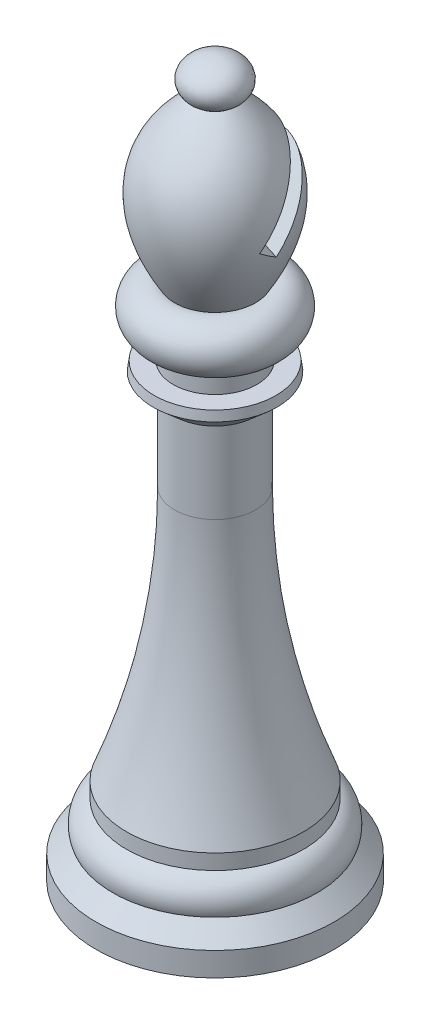
ISO-10303-21;
HEADER;
FILE_DESCRIPTION(('STEP AP214'),'2;1');
FILE_NAME('part.step','',(''),(''),'','','');
FILE_SCHEMA(('AUTOMOTIVE_DESIGN { 1 0 10303 214 1 1 1 1 }'));
ENDSEC;
DATA;
#1=APPLICATION_CONTEXT('core data for automotive mechanical design processes');
#2=APPLICATION_PROTOCOL_DEFINITION('international standard','automotive_design',2000,#1);
#3=PRODUCT_CONTEXT('',#1,'mechanical');
#4=PRODUCT('Part','Part','',(#3));
#5=PRODUCT_RELATED_PRODUCT_CATEGORY('part','',(#4));
#6=PRODUCT_DEFINITION_FORMATION('','',#4);
#7=PRODUCT_DEFINITION_CONTEXT('part definition',#1,'design');
#8=PRODUCT_DEFINITION('design','',#6,#7);
#9=PRODUCT_DEFINITION_SHAPE('','',#8);
#10=(LENGTH_UNIT() NAMED_UNIT(*) SI_UNIT(.MILLI.,.METRE.));
#11=(NAMED_UNIT(*) PLANE_ANGLE_UNIT() SI_UNIT($,.RADIAN.));
#12=(NAMED_UNIT(*) SI_UNIT($,.STERADIAN.) SOLID_ANGLE_UNIT());
#13=UNCERTAINTY_MEASURE_WITH_UNIT(LENGTH_MEASURE(1.E-05),#10,'distance_accuracy_value','');
#14=(GEOMETRIC_REPRESENTATION_CONTEXT(3) GLOBAL_UNCERTAINTY_ASSIGNED_CONTEXT((#13)) GLOBAL_UNIT_ASSIGNED_CONTEXT((#10,
#11,#12)) REPRESENTATION_CONTEXT('',''));
#15=CARTESIAN_POINT('',(0.,0.,0.));
#16=DIRECTION('',(0.,0.,1.));
#17=DIRECTION('',(1.,0.,0.));
#18=AXIS2_PLACEMENT_3D('',#15,#16,#17);
#19=CARTESIAN_POINT('',(1.00027326815392,36.2297140379985,0.));
#20=CARTESIAN_POINT('',(5.27541449812885,32.9314503318034,0.));
#21=CARTESIAN_POINT('',(2.16294521673095,27.7758178204863,0.));
#22=B_SPLINE_CURVE_WITH_KNOTS('',2,(#19,#20,#21),.UNSPECIFIED.,.F.,.F.,(3,3),(0.,1.),.UNSPECIFIED.);
#23=CARTESIAN_POINT('',(0.,0.,0.));
#24=DIRECTION('',(0.,-1.,0.));
#25=AXIS1_PLACEMENT('',#23,#24);
#26=SURFACE_OF_REVOLUTION('',#22,#25);
#27=CARTESIAN_POINT('',(0.,36.2297140379985,0.));
#28=DIRECTION('',(0.,-1.,0.));
#29=DIRECTION('',(0.,0.,-1.));
#30=AXIS2_PLACEMENT_3D('',#27,#28,#29);
#31=CIRCLE('',#30,1.00027326815392);
#32=CARTESIAN_POINT('',(0.,36.2297140379985,-1.00027326815392));
#33=VERTEX_POINT('',#32);
#34=EDGE_CURVE('E87',#33,#33,#31,.T.);
#35=ORIENTED_EDGE('',*,*,#34,.T.);
#36=EDGE_LOOP('',(#35));
#37=FACE_BOUND('',#36,.T.);
#38=CARTESIAN_POINT('',(0.,27.7758178204863,0.));
#39=DIRECTION('',(0.,-1.,0.));
#40=DIRECTION('',(0.,0.,-1.));
#41=AXIS2_PLACEMENT_3D('',#38,#39,#40);
#42=CIRCLE('',#41,2.16294521673095);
#43=CARTESIAN_POINT('',(0.,27.7758178204863,-2.16294521673095));
#44=VERTEX_POINT('',#43);
#45=EDGE_CURVE('E305',#44,#44,#42,.T.);
#46=ORIENTED_EDGE('',*,*,#45,.F.);
#47=EDGE_LOOP('',(#46));
#48=FACE_BOUND('',#47,.T.);
#49=CARTESIAN_POINT('',(3.28289071920414,30.3475365563568,0.146879739243502));
#50=CARTESIAN_POINT('',(3.30739566453259,30.4346457791315,0.0910765578843733));
#51=CARTESIAN_POINT('',(3.32871348183493,30.5219162735567,0.0341535928762741));
#52=CARTESIAN_POINT('',(3.36459165647857,30.6964938412345,-0.0818439158584685));
#53=CARTESIAN_POINT('',(3.37914772383222,30.7838009026297,-0.14091979994399));
#54=CARTESIAN_POINT('',(3.4121455490095,31.0458856481982,-0.32162204256579));
#55=CARTESIAN_POINT('',(3.41971199591901,31.220116538539,-0.446269533987425));
#56=CARTESIAN_POINT('',(3.40284418352598,31.5616607799071,-0.70058388472676));
#57=CARTESIAN_POINT('',(3.37863120380716,31.7290136848451,-0.830209999432373));
#58=CARTESIAN_POINT('',(3.31716748616846,31.9717966144672,-1.02654364405817));
#59=CARTESIAN_POINT('',(3.29249793366688,32.0513314973952,-1.09228770572346));
#60=CARTESIAN_POINT('',(3.23466661455085,32.2070404251162,-1.22399594795197));
#61=CARTESIAN_POINT('',(3.20150847278785,32.2832158882337,-1.28996002272628));
#62=CARTESIAN_POINT('',(3.12640510657,32.432023147504,-1.42206771846514));
#63=CARTESIAN_POINT('',(3.0844008753129,32.5046268906878,-1.48820944173056));
#64=CARTESIAN_POINT('',(2.9918483733432,32.64495155537,-1.61961966889064));
#65=CARTESIAN_POINT('',(2.94130440317388,32.7126749102249,-1.68488859455333));
#66=CARTESIAN_POINT('',(2.83181026173759,32.8425768490505,-1.81402727433951));
#67=CARTESIAN_POINT('',(2.77285356019037,32.904751064051,-1.87789589664355));
#68=CARTESIAN_POINT('',(2.6469115552805,33.0227076792522,-2.00349767647071));
#69=CARTESIAN_POINT('',(2.57993126542464,33.0784940286969,-2.06523213675828));
#70=CARTESIAN_POINT('',(2.44612591240476,33.1772392949089,-2.17930012905844));
#71=CARTESIAN_POINT('',(2.38008871287919,33.2209339960284,-2.2319223536804));
#72=CARTESIAN_POINT('',(2.24241439979847,33.3021687849837,-2.33444056450346));
#73=CARTESIAN_POINT('',(2.17078055362957,33.3397124248084,-2.38433811291603));
#74=CARTESIAN_POINT('',(2.02241899185135,33.4081690843677,-2.48090080055351));
#75=CARTESIAN_POINT('',(1.94569447826206,33.4390862213421,-2.52756793465296));
#76=CARTESIAN_POINT('',(1.78770232576549,33.4938814932487,-2.61719887031084));
#77=CARTESIAN_POINT('',(1.70643513555066,33.5177603219172,-2.66016303655959));
#78=CARTESIAN_POINT('',(1.54852810404349,33.5560589258623,-2.73773995378869));
#79=CARTESIAN_POINT('',(1.47225984433482,33.5711943458995,-2.77275761572079));
#80=CARTESIAN_POINT('',(1.31715351578733,33.5953007195932,-2.83910668902551));
#81=CARTESIAN_POINT('',(1.23831461335242,33.6042696523623,-2.87043688915404));
#82=CARTESIAN_POINT('',(1.07876586611293,33.6159031947374,-2.92908931181643));
#83=CARTESIAN_POINT('',(0.998057478181527,33.6185725570082,-2.95641454126357));
#84=CARTESIAN_POINT('',(0.835365551001336,33.6175918931001,-3.00685869002682));
#85=CARTESIAN_POINT('',(0.753381565492461,33.6139396037195,-3.02997609963527));
#86=CARTESIAN_POINT('',(0.516702885219877,33.5943769112375,-3.09013804793633));
#87=CARTESIAN_POINT('',(0.361154498955149,33.5705370098276,-3.12166986144353));
#88=CARTESIAN_POINT('',(0.052411468459435,33.5018170097783,-3.1686535350598));
#89=CARTESIAN_POINT('',(-0.100782979126392,33.4569351630839,-3.18410405887572));
#90=CARTESIAN_POINT('',(-0.403720882142854,33.3470491155261,-3.19924929174036));
#91=CARTESIAN_POINT('',(-0.55335148105557,33.2816949814056,-3.1986533862155));
#92=CARTESIAN_POINT('',(-0.842749510702654,33.133596182917,-3.18168112135541));
#93=CARTESIAN_POINT('',(-0.982514621717074,33.050847446547,-3.16530106379429));
#94=CARTESIAN_POINT('',(-1.25958121078357,32.8637226323111,-3.11599836943598));
#95=CARTESIAN_POINT('',(-1.39588429492666,32.75817935788,-3.08191081386171));
#96=CARTESIAN_POINT('',(-1.65129435260489,32.533271161257,-2.99825134681673));
#97=CARTESIAN_POINT('',(-1.77039580786446,32.4139018257019,-2.94867448244458));
#98=CARTESIAN_POINT('',(-1.93995067942691,32.2211684386615,-2.86147525028221));
#99=CARTESIAN_POINT('',(-1.99709396477578,32.151407372221,-2.82858337239887));
#100=CARTESIAN_POINT('',(-2.1055410486553,32.0092545327673,-2.75904539339884));
#101=CARTESIAN_POINT('',(-2.1568451503602,31.9368628965929,-2.72239948738165));
#102=CARTESIAN_POINT('',(-2.25349347577079,31.789964745634,-2.64569167013681));
#103=CARTESIAN_POINT('',(-2.29883829578294,31.715458443359,-2.6056301013547));
#104=CARTESIAN_POINT('',(-2.38356652705777,31.5647710965063,-2.52241136810325));
#105=CARTESIAN_POINT('',(-2.42294705033473,31.488589260931,-2.47925271880136));
#106=CARTESIAN_POINT('',(-2.54092903120835,31.2396841855446,-2.3348830045978));
#107=CARTESIAN_POINT('',(-2.60759322330927,31.0644179890326,-2.22806422166601));
#108=CARTESIAN_POINT('',(-2.71220232410782,30.7119821377859,-2.00400800572556));
#109=CARTESIAN_POINT('',(-2.75012161661181,30.5348109276237,-1.88676138358502));
#110=CARTESIAN_POINT('',(-2.78547250171757,30.2805274615796,-1.71248676120583));
#111=CARTESIAN_POINT('',(-2.79368937343487,30.2027552951701,-1.65836911282801));
#112=CARTESIAN_POINT('',(-2.80506640962539,30.0477817972258,-1.54895989387154));
#113=CARTESIAN_POINT('',(-2.80823216753689,29.9705799286291,-1.49366969061524));
#114=CARTESIAN_POINT('',(-2.80968604863595,29.8171998595871,-1.38230181984043));
#115=CARTESIAN_POINT('',(-2.8079944059348,29.7410187368691,-1.32622838447272));
#116=CARTESIAN_POINT('',(-2.79991918763948,29.5894642447292,-1.21319502676869));
#117=CARTESIAN_POINT('',(-2.79353156473607,29.5140916290218,-1.15623438125172));
#118=CARTESIAN_POINT('',(-2.78486870103948,29.4392440249039,-1.09894104825655));
#119=B_SPLINE_CURVE_WITH_KNOTS('',3,(#49,#50,#51,#52,#53,#54,#55,#56,#57,#58,#59,#60,#61,#62,
#63,#64,#65,#66,#67,#68,#69,#70,#71,#72,#73,#74,#75,#76,#77,#78,#79,#80,#81,#82,#83,#84,#85,#86,
#87,#88,#89,#90,#91,#92,#93,#94,#95,#96,#97,#98,#99,#100,#101,#102,#103,#104,#105,#106,#107,
#108,#109,#110,#111,#112,#113,#114,#115,#116,#117,#118),.UNSPECIFIED.,.F.,.F.,(4,2,2,2,2,2,2,2,
2,2,2,2,2,2,2,2,2,2,2,2,2,2,2,2,2,2,2,2,2,2,2,2,2,2,4),(0.,0.318844017788566,0.637890050587816,
1.27856193841117,1.91479641923145,2.23275891757237,2.55058586337101,2.87060408246469,
3.19046162072267,3.5105688089673,3.83047701274286,4.115316703928,4.3999913275295,
4.68448855840563,4.96895773820623,5.22445711510258,5.48004018465832,5.73543036971176,
5.9909120053937,6.46993714846769,6.94900209350626,7.43674905397591,7.92461032132313,
8.44962869816349,8.97481512835657,9.26253467886508,9.55023928396404,9.83791507838369,
10.125729726647,10.7705316887195,11.4159075966859,11.7011092441502,11.9859948488941,
12.2696954507169,12.5536408517343),.UNSPECIFIED.);
#120=CARTESIAN_POINT('',(3.32013077300235,30.4902616829391,0.054533188415232));
#121=VERTEX_POINT('',#120);
#122=CARTESIAN_POINT('',(-2.75382634408267,30.4902616829391,-1.85544676159467));
#123=VERTEX_POINT('',#122);
#124=EDGE_CURVE('E11',#121,#123,#119,.T.);
#125=ORIENTED_EDGE('',*,*,#124,.F.);
#126=CARTESIAN_POINT('',(3.27319233672416,31.1593243859053,1.04820710477854));
#127=CARTESIAN_POINT('',(3.29486884035974,31.0930829056387,0.955181972038542));
#128=CARTESIAN_POINT('',(3.31160027531774,31.0270608597655,0.86093258172998));
#129=CARTESIAN_POINT('',(3.33512804855597,30.8958799461817,0.670610681754513));
#130=CARTESIAN_POINT('',(3.34192442836695,30.830721074864,0.574538179710322));
#131=CARTESIAN_POINT('',(3.34734413096126,30.6371614867713,0.284502880781126));
#132=CARTESIAN_POINT('',(3.33099350791637,30.5106916931443,0.0887418196909726));
#133=CARTESIAN_POINT('',(3.25976249429006,30.2712033540758,-0.294621965594113));
#134=CARTESIAN_POINT('',(3.20617655959479,30.1578779792932,-0.482280106533866));
#135=CARTESIAN_POINT('',(3.06235480401658,29.9435079055063,-0.850611241610111));
#136=CARTESIAN_POINT('',(2.97214150369579,29.8424557097731,-1.03128845338923));
#137=CARTESIAN_POINT('',(2.81211027122135,29.7045666487194,-1.28944195841348));
#138=CARTESIAN_POINT('',(2.7557264422415,29.6614664473747,-1.37213415604832));
#139=CARTESIAN_POINT('',(2.63490333506536,29.5795263685417,-1.53363031538285));
#140=CARTESIAN_POINT('',(2.57046833415689,29.5406842493114,-1.61243631090143));
#141=CARTESIAN_POINT('',(2.43381968663126,29.4677101516073,-1.76539504482241));
#142=CARTESIAN_POINT('',(2.36160364560027,29.4335796304188,-1.83954633968811));
#143=CARTESIAN_POINT('',(2.20983291580817,29.3705057108861,-1.98233838968447));
#144=CARTESIAN_POINT('',(2.13027944008037,29.341561457462,-2.05098005217726));
#145=CARTESIAN_POINT('',(1.97234980003041,29.2918037053487,-2.17563821887409));
#146=CARTESIAN_POINT('',(1.8945920220891,29.2704767257871,-2.23223420473015));
#147=CARTESIAN_POINT('',(1.73405812978078,29.2327112485538,-2.33963612732694));
#148=CARTESIAN_POINT('',(1.65128280129051,29.2162719877097,-2.39044296722462));
#149=CARTESIAN_POINT('',(1.48155143655996,29.1885563175991,-2.48558966298299));
#150=CARTESIAN_POINT('',(1.39460638261902,29.1772670893709,-2.52994538658777));
#151=CARTESIAN_POINT('',(1.21710539736459,29.159973147302,-2.61182729003924));
#152=CARTESIAN_POINT('',(1.12655229399399,29.1539643766801,-2.64935869514558));
#153=CARTESIAN_POINT('',(1.0050122151014,29.1495685611332,-2.6942029774859));
#154=CARTESIAN_POINT('',(0.975265938336568,29.1487761278986,-2.70475119453446));
#155=CARTESIAN_POINT('',(0.915539112260839,29.14774837292,-2.7250815993171));
#156=CARTESIAN_POINT('',(0.88555885108079,29.1475124496378,-2.73486460310604));
#157=CARTESIAN_POINT('',(0.855455770516862,29.1475542517186,-2.74426763089485));
#158=B_SPLINE_CURVE_WITH_KNOTS('',3,(#126,#127,#128,#129,#130,#131,#132,#133,#134,#135,#136,
#137,#138,#139,#140,#141,#142,#143,#144,#145,#146,#147,#148,#149,#150,#151,#152,#153,#154,#155,
#156,#157),.UNSPECIFIED.,.F.,.F.,(4,2,2,2,2,2,2,2,2,2,2,2,2,2,2,4),(0.,0.348472920187196,
0.696944383675538,1.39395949505938,2.06788217390171,2.74139111322119,3.06794178763211,
3.39431970962672,3.72079835438508,4.04722312172618,4.34235181432588,4.63743440106805,
4.93177843464629,5.22589613634928,5.32059868379913,5.41519881913567),.UNSPECIFIED.);
#159=CARTESIAN_POINT('',(3.29936827198848,31.0703755437763,0.922371533769497));
#160=VERTEX_POINT('',#159);
#161=EDGE_CURVE('E53',#160,#121,#158,.T.);
#162=ORIENTED_EDGE('',*,*,#161,.F.);
#163=CARTESIAN_POINT('',(-3.17089782823849,29.9966023620174,-0.329371839210895));
#164=CARTESIAN_POINT('',(-3.195397472757,30.1053213729705,-0.416339791001454));
#165=CARTESIAN_POINT('',(-3.21444554702614,30.2157024392732,-0.502805232187374));
#166=CARTESIAN_POINT('',(-3.24127503623436,30.4391346185357,-0.67413992390359));
#167=CARTESIAN_POINT('',(-3.24905026901187,30.5521871620553,-0.759008273409124));
#168=CARTESIAN_POINT('',(-3.25295505097614,30.7809004785965,-0.926984526948753));
#169=CARTESIAN_POINT('',(-3.2490114578832,30.8965731423327,-1.01007810028452));
#170=CARTESIAN_POINT('',(-3.22890209062054,31.1290105306395,-1.17321812407155));
#171=CARTESIAN_POINT('',(-3.21273680287498,31.245775211565,-1.25326469566047));
#172=CARTESIAN_POINT('',(-3.16810177035607,31.4779912378756,-1.40853113781565));
#173=CARTESIAN_POINT('',(-3.1397902070304,31.5934405193002,-1.48379924439172));
#174=CARTESIAN_POINT('',(-3.07066690069404,31.8234305802816,-1.62974236347988));
#175=CARTESIAN_POINT('',(-3.02986151174899,31.9379717913536,-1.70041968865866));
#176=CARTESIAN_POINT('',(-2.93580572021969,32.1647686691865,-1.83619462962278));
#177=CARTESIAN_POINT('',(-2.88259001871128,32.2770297769993,-1.90130712421576));
#178=CARTESIAN_POINT('',(-2.76380203819407,32.4983866944989,-2.02533880959869));
#179=CARTESIAN_POINT('',(-2.6982319743618,32.6074830675922,-2.08425910772343));
#180=CARTESIAN_POINT('',(-2.56468782944501,32.806990408259,-2.18772075304774));
#181=CARTESIAN_POINT('',(-2.49820402795582,32.8979511478628,-2.23313154775106));
#182=CARTESIAN_POINT('',(-2.35660926208983,33.0757975792731,-2.31826928996698));
#183=CARTESIAN_POINT('',(-2.28149534564568,33.1626818622644,-2.35799428206318));
#184=CARTESIAN_POINT('',(-2.12313774756195,33.3315451952944,-2.43131156334171));
#185=CARTESIAN_POINT('',(-2.03989168984707,33.4135228003329,-2.46490205184913));
#186=CARTESIAN_POINT('',(-1.86584943137061,33.571757113663,-2.52553791314564));
#187=CARTESIAN_POINT('',(-1.77505090928634,33.6480120492357,-2.55258126354663));
#188=CARTESIAN_POINT('',(-1.59518978166979,33.7872913479251,-2.59756779582506));
#189=CARTESIAN_POINT('',(-1.50672086344301,33.8508882368066,-2.61611507729927));
#190=CARTESIAN_POINT('',(-1.32468996344076,33.9719946168423,-2.6471699574914));
#191=CARTESIAN_POINT('',(-1.23112804786979,34.0295041870978,-2.65967763469802));
#192=CARTESIAN_POINT('',(-1.03959447467189,34.1377239500241,-2.67834909523295));
#193=CARTESIAN_POINT('',(-0.941624947330604,34.1884373812337,-2.6845159095646));
#194=CARTESIAN_POINT('',(-0.742014333816762,34.2823493140027,-2.69021608032193));
#195=CARTESIAN_POINT('',(-0.640375495864355,34.3255523259648,-2.68975343211576));
#196=CARTESIAN_POINT('',(-0.443644655093423,34.4001626552385,-2.68228690827449));
#197=CARTESIAN_POINT('',(-0.348801596309808,34.4322866103385,-2.6758837943258));
#198=CARTESIAN_POINT('',(-0.15754742311404,34.4891797580665,-2.6572223368005));
#199=CARTESIAN_POINT('',(-0.0611372920179665,34.5139533882524,-2.64496753772892));
#200=CARTESIAN_POINT('',(0.132344790985305,34.5556576273421,-2.61453170347435));
#201=CARTESIAN_POINT('',(0.229415977763609,34.5725961173372,-2.59635665476889));
#202=CARTESIAN_POINT('',(0.423354203699162,34.5982858509456,-2.55410166372322));
#203=CARTESIAN_POINT('',(0.520221270625953,34.6070382910793,-2.53002258499976));
#204=CARTESIAN_POINT('',(0.699809308310169,34.615538967482,-2.47974801455283));
#205=CARTESIAN_POINT('',(0.782683769843987,34.6163381497216,-2.45427047188539));
#206=CARTESIAN_POINT('',(0.94690328327347,34.6116347717854,-2.39920189418107));
#207=CARTESIAN_POINT('',(1.02824784813862,34.6061302382642,-2.36960957358283));
#208=CARTESIAN_POINT('',(1.18873668315794,34.588916377223,-2.30659308482914));
#209=CARTESIAN_POINT('',(1.26788166985223,34.5772090958637,-2.27317018315238));
#210=CARTESIAN_POINT('',(1.42345909314903,34.5477994973444,-2.20280654172281));
#211=CARTESIAN_POINT('',(1.49989045645552,34.5300948366441,-2.16586443086355));
#212=CARTESIAN_POINT('',(1.71890319375943,34.4698822327198,-2.05309570703084));
#213=CARTESIAN_POINT('',(1.85721400493624,34.419586438693,-1.97293408880615));
#214=CARTESIAN_POINT('',(2.11922966654683,34.3002159000547,-1.803512555552));
#215=CARTESIAN_POINT('',(2.24293020669047,34.2311356334396,-1.71424996997457));
#216=CARTESIAN_POINT('',(2.48595944593215,34.0688131408394,-1.51948374368465));
#217=CARTESIAN_POINT('',(2.60353608501628,33.9738186386112,-1.41325351039398));
#218=CARTESIAN_POINT('',(2.81725452495022,33.7672919880142,-1.1954761860443));
#219=CARTESIAN_POINT('',(2.91338682214917,33.6557525436126,-1.08392676411588));
#220=CARTESIAN_POINT('',(3.09306923784693,33.4049214977631,-0.84455112732601));
#221=CARTESIAN_POINT('',(3.17375025281207,33.2639065528932,-0.716370672757356));
#222=CARTESIAN_POINT('',(3.30544572067743,32.9688480983193,-0.459839775575238));
#223=CARTESIAN_POINT('',(3.3564553351614,32.8148024684334,-0.33148930865666));
#224=CARTESIAN_POINT('',(3.43112776255087,32.4860882581886,-0.0683520781262505));
#225=CARTESIAN_POINT('',(3.45252284074208,32.3107350895105,0.0662207011823617));
#226=CARTESIAN_POINT('',(3.46170982939635,31.9543781304132,0.328919317914599));
#227=CARTESIAN_POINT('',(3.44949142360099,31.7733726220984,0.457043163818702));
#228=CARTESIAN_POINT('',(3.4053368546854,31.4862546914653,0.652488107859176));
#229=CARTESIAN_POINT('',(3.38377832895784,31.3804649218404,0.722837258399269));
#230=CARTESIAN_POINT('',(3.3306518500182,31.1695157792129,0.859928450972803));
#231=CARTESIAN_POINT('',(3.29911343499518,31.0643554673172,0.926680465927487));
#232=CARTESIAN_POINT('',(3.26282974770322,30.9596772471445,0.991588831787256));
#233=B_SPLINE_CURVE_WITH_KNOTS('',3,(#163,#164,#165,#166,#167,#168,#169,#170,#171,#172,#173,
#174,#175,#176,#177,#178,#179,#180,#181,#182,#183,#184,#185,#186,#187,#188,#189,#190,#191,#192,
#193,#194,#195,#196,#197,#198,#199,#200,#201,#202,#203,#204,#205,#206,#207,#208,#209,#210,#211,
#212,#213,#214,#215,#216,#217,#218,#219,#220,#221,#222,#223,#224,#225,#226,#227,#228,#229,#230,
#231,#232),.UNSPECIFIED.,.F.,.F.,(4,2,2,2,2,2,2,2,2,2,2,2,2,2,2,2,2,2,2,2,2,2,2,2,2,2,2,2,2,2,2,
2,2,2,4),(0.,0.424009922627013,0.848252289542104,1.27514808735479,1.70202689558435,
2.12350759217504,2.54477428865651,2.96487689266564,3.38490424249856,3.74884239132331,
4.11290540368287,4.47707510913206,4.84135716221179,5.17249562930481,5.50362979291571,
5.83460559700444,6.16538194079894,6.46597382422086,6.76638386250454,7.06649106829333,
7.36655440182017,7.62633976223429,7.88620646933763,8.1459875050132,8.40587017023994,
8.90636079289557,9.40699870232319,9.9590246570806,10.5112947734422,11.1294483459504,
11.7477026904611,12.4110822805632,13.0746654901023,13.4608539342995,13.8459098751992),.UNSPECIFIED.);
#234=CARTESIAN_POINT('',(-3.23347865360801,31.0703755437763,-1.13190813990085));
#235=VERTEX_POINT('',#234);
#236=EDGE_CURVE('E70',#235,#160,#233,.T.);
#237=ORIENTED_EDGE('',*,*,#236,.F.);
#238=CARTESIAN_POINT('',(-0.664287531347692,29.367708640694,-2.89033282308146));
#239=CARTESIAN_POINT('',(-0.767602562491574,29.3970440689544,-2.87860529727298));
#240=CARTESIAN_POINT('',(-0.869632280986258,29.4290160587733,-2.86249968520072));
#241=CARTESIAN_POINT('',(-1.07030130214773,29.4977578151994,-2.8219909601744));
#242=CARTESIAN_POINT('',(-1.16894281803215,29.5345243716268,-2.79759338166674));
#243=CARTESIAN_POINT('',(-1.36171785729887,29.612243848302,-2.74107083961087));
#244=CARTESIAN_POINT('',(-1.45586977050048,29.6531770588089,-2.70898136600125));
#245=CARTESIAN_POINT('',(-1.63950724897966,29.7389099918651,-2.63750732964801));
#246=CARTESIAN_POINT('',(-1.72899231834084,29.7837101239905,-2.59812199363462));
#247=CARTESIAN_POINT('',(-1.97616276468387,29.9160674075696,-2.47635235627677));
#248=CARTESIAN_POINT('',(-2.12767444778823,30.0078021806824,-2.3857300599562));
#249=CARTESIAN_POINT('',(-2.41005028265758,30.2004083370254,-2.18422176181324));
#250=CARTESIAN_POINT('',(-2.54089546778765,30.3012879808596,-2.0733173451958));
#251=CARTESIAN_POINT('',(-2.7910886692681,30.5199098642147,-1.82247730803733));
#252=CARTESIAN_POINT('',(-2.90806256641501,30.638336508306,-1.68076357860451));
#253=CARTESIAN_POINT('',(-3.11118401530386,30.8801335528367,-1.38019125646525));
#254=CARTESIAN_POINT('',(-3.19731564913113,31.003506469665,-1.22132386552097));
#255=CARTESIAN_POINT('',(-3.30248119835668,31.1916590017922,-0.970803741698632));
#256=CARTESIAN_POINT('',(-3.3338268188462,31.2559466212828,-0.883764026099089));
#257=CARTESIAN_POINT('',(-3.38728374024543,31.3844642883057,-0.706867600815234));
#258=CARTESIAN_POINT('',(-3.40939858566473,31.4486943484689,-0.617011986678422));
#259=CARTESIAN_POINT('',(-3.44410477601278,31.5765320965679,-0.43524411626731));
#260=CARTESIAN_POINT('',(-3.45670913165749,31.6401405168375,-0.343334847466263));
#261=CARTESIAN_POINT('',(-3.47222915109761,31.7663108563814,-0.158046983845695));
#262=CARTESIAN_POINT('',(-3.47515013098474,31.8288733310937,-0.0646692235173584));
#263=CARTESIAN_POINT('',(-3.47183941071307,31.9316382418092,0.0912625885068187));
#264=CARTESIAN_POINT('',(-3.46835967424805,31.9722729387516,0.15360279256566));
#265=CARTESIAN_POINT('',(-3.45706667813981,32.0526672068883,0.27832687519319));
#266=CARTESIAN_POINT('',(-3.44925964559996,32.0924279504447,0.340710562648182));
#267=CARTESIAN_POINT('',(-3.43927695655666,32.1317120081867,0.403059916982517));
#268=B_SPLINE_CURVE_WITH_KNOTS('',3,(#238,#239,#240,#241,#242,#243,#244,#245,#246,#247,#248,
#249,#250,#251,#252,#253,#254,#255,#256,#257,#258,#259,#260,#261,#262,#263,#264,#265,#266,#267),
.UNSPECIFIED.,.F.,.F.,(4,2,2,2,2,2,2,2,2,2,2,2,2,2,4),(0.,0.323928747312111,0.647641712634455,
0.969888900728666,1.29217026253848,1.88642331430763,2.48121861078023,3.13415574157227,
3.78742937387358,4.12505310211933,4.46254706727384,4.79957848638609,5.13642484742061,
5.35978946482,5.58283348549256),.UNSPECIFIED.);
#269=EDGE_CURVE('E72',#123,#235,#268,.T.);
#270=ORIENTED_EDGE('',*,*,#269,.F.);
#271=EDGE_LOOP('',(#125,#162,#237,#270));
#272=FACE_BOUND('',#271,.T.);
#273=ADVANCED_FACE('F39',(#37,#48,#272),#26,.T.);
#274=CARTESIAN_POINT('',(0.,0.,0.));
#275=DIRECTION('',(0.,-1.,0.));
#276=DIRECTION('',(0.,0.,-1.));
#277=AXIS2_PLACEMENT_3D('',#274,#275,#276);
#278=PLANE('',#277);
#279=CARTESIAN_POINT('',(0.,0.,0.));
#280=DIRECTION('',(0.,-1.,0.));
#281=DIRECTION('',(0.,0.,-1.));
#282=AXIS2_PLACEMENT_3D('',#279,#280,#281);
#283=CIRCLE('',#282,6.35);
#284=CARTESIAN_POINT('',(0.,0.,-6.35));
#285=VERTEX_POINT('',#284);
#286=EDGE_CURVE('E76',#285,#285,#283,.T.);
#287=ORIENTED_EDGE('',*,*,#286,.T.);
#288=EDGE_LOOP('',(#287));
#289=FACE_BOUND('',#288,.T.);
#290=ADVANCED_FACE('F41',(#289),#278,.T.);
#291=CARTESIAN_POINT('',(0.,0.,0.));
#292=DIRECTION('',(0.,-1.,0.));
#293=DIRECTION('',(0.,0.,-1.));
#294=AXIS2_PLACEMENT_3D('',#291,#292,#293);
#295=CYLINDRICAL_SURFACE('',#294,6.35);
#296=CARTESIAN_POINT('',(0.,1.27,0.));
#297=DIRECTION('',(0.,-1.,0.));
#298=DIRECTION('',(0.,0.,-1.));
#299=AXIS2_PLACEMENT_3D('',#296,#297,#298);
#300=CIRCLE('',#299,6.35);
#301=CARTESIAN_POINT('',(0.,1.27,-6.35));
#302=VERTEX_POINT('',#301);
#303=EDGE_CURVE('E274',#302,#302,#300,.T.);
#304=ORIENTED_EDGE('',*,*,#303,.T.);
#305=EDGE_LOOP('',(#304));
#306=FACE_BOUND('',#305,.T.);
#307=ORIENTED_EDGE('',*,*,#286,.F.);
#308=EDGE_LOOP('',(#307));
#309=FACE_BOUND('',#308,.T.);
#310=ADVANCED_FACE('F239',(#306,#309),#295,.T.);
#311=CARTESIAN_POINT('',(0.,1.27,0.));
#312=DIRECTION('',(0.,-1.,0.));
#313=DIRECTION('',(0.,0.,-1.));
#314=AXIS2_PLACEMENT_3D('',#311,#312,#313);
#315=CONICAL_SURFACE('',#314,6.35,0.785398163397448);
#316=CARTESIAN_POINT('',(0.,2.16802561210692,0.));
#317=DIRECTION('',(0.,-1.,0.));
#318=DIRECTION('',(0.,0.,-1.));
#319=AXIS2_PLACEMENT_3D('',#316,#317,#318);
#320=CIRCLE('',#319,5.45197438789309);
#321=CARTESIAN_POINT('',(0.,2.16802561210692,-5.45197438789309));
#322=VERTEX_POINT('',#321);
#323=EDGE_CURVE('E276',#322,#322,#320,.T.);
#324=ORIENTED_EDGE('',*,*,#323,.T.);
#325=EDGE_LOOP('',(#324));
#326=FACE_BOUND('',#325,.T.);
#327=ORIENTED_EDGE('',*,*,#303,.F.);
#328=EDGE_LOOP('',(#327));
#329=FACE_BOUND('',#328,.T.);
#330=ADVANCED_FACE('F230',(#326,#329),#315,.T.);
#331=CARTESIAN_POINT('',(0.,2.62161283868323,0.));
#332=DIRECTION('',(0.,-1.,0.));
#333=DIRECTION('',(0.,0.,-1.));
#334=AXIS2_PLACEMENT_3D('',#331,#332,#333);
#335=TOROIDAL_SURFACE('',#334,4.26573721603966,1.27);
#336=CARTESIAN_POINT('',(0.,3.80785001053665,0.));
#337=DIRECTION('',(0.,-1.,0.));
#338=DIRECTION('',(0.,0.,-1.));
#339=AXIS2_PLACEMENT_3D('',#336,#337,#338);
#340=CIRCLE('',#339,4.71932444261598);
#341=CARTESIAN_POINT('',(0.,3.80785001053665,-4.71932444261598));
#342=VERTEX_POINT('',#341);
#343=EDGE_CURVE('E281',#342,#342,#340,.T.);
#344=ORIENTED_EDGE('',*,*,#343,.T.);
#345=EDGE_LOOP('',(#344));
#346=FACE_BOUND('',#345,.T.);
#347=ORIENTED_EDGE('',*,*,#323,.F.);
#348=EDGE_LOOP('',(#347));
#349=FACE_BOUND('',#348,.T.);
#350=ADVANCED_FACE('F221',(#346,#349),#335,.T.);
#351=CARTESIAN_POINT('',(0.,0.,0.));
#352=DIRECTION('',(0.,-1.,0.));
#353=DIRECTION('',(0.,0.,-1.));
#354=AXIS2_PLACEMENT_3D('',#351,#352,#353);
#355=CYLINDRICAL_SURFACE('',#354,4.71932444261598);
#356=CARTESIAN_POINT('',(0.,4.61815738923941,0.));
#357=DIRECTION('',(0.,-1.,0.));
#358=DIRECTION('',(0.,0.,-1.));
#359=AXIS2_PLACEMENT_3D('',#356,#357,#358);
#360=CIRCLE('',#359,4.71932444261598);
#361=CARTESIAN_POINT('',(0.,4.61815738923941,-4.71932444261598));
#362=VERTEX_POINT('',#361);
#363=EDGE_CURVE('E284',#362,#362,#360,.T.);
#364=ORIENTED_EDGE('',*,*,#363,.T.);
#365=EDGE_LOOP('',(#364));
#366=FACE_BOUND('',#365,.T.);
#367=ORIENTED_EDGE('',*,*,#343,.F.);
#368=EDGE_LOOP('',(#367));
#369=FACE_BOUND('',#368,.T.);
#370=ADVANCED_FACE('F212',(#366,#369),#355,.T.);
#371=CARTESIAN_POINT('',(4.71932444261598,4.61815738923941,0.));
#372=CARTESIAN_POINT('',(2.19120734143967,11.1494256276847,0.));
#373=CARTESIAN_POINT('',(2.16294521673095,18.2109268182494,0.));
#374=B_SPLINE_CURVE_WITH_KNOTS('',2,(#371,#372,#373),.UNSPECIFIED.,.F.,.F.,(3,3),(0.,1.),.UNSPECIFIED.);
#375=CARTESIAN_POINT('',(0.,0.,0.));
#376=DIRECTION('',(0.,-1.,0.));
#377=AXIS1_PLACEMENT('',#375,#376);
#378=SURFACE_OF_REVOLUTION('',#374,#377);
#379=CARTESIAN_POINT('',(0.,18.2109268182494,0.));
#380=DIRECTION('',(0.,-1.,0.));
#381=DIRECTION('',(0.,0.,-1.));
#382=AXIS2_PLACEMENT_3D('',#379,#380,#381);
#383=CIRCLE('',#382,2.16294521673095);
#384=CARTESIAN_POINT('',(0.,18.2109268182494,-2.16294521673095));
#385=VERTEX_POINT('',#384);
#386=EDGE_CURVE('E287',#385,#385,#383,.T.);
#387=ORIENTED_EDGE('',*,*,#386,.T.);
#388=EDGE_LOOP('',(#387));
#389=FACE_BOUND('',#388,.T.);
#390=ORIENTED_EDGE('',*,*,#363,.F.);
#391=EDGE_LOOP('',(#390));
#392=FACE_BOUND('',#391,.T.);
#393=ADVANCED_FACE('F203',(#389,#392),#378,.F.);
#394=CARTESIAN_POINT('',(0.,0.,0.));
#395=DIRECTION('',(0.,-1.,0.));
#396=DIRECTION('',(0.,0.,-1.));
#397=AXIS2_PLACEMENT_3D('',#394,#395,#396);
#398=CYLINDRICAL_SURFACE('',#397,2.16294521673095);
#399=ORIENTED_EDGE('',*,*,#386,.F.);
#400=EDGE_LOOP('',(#399));
#401=FACE_BOUND('',#400,.T.);
#402=CARTESIAN_POINT('',(0.,22.5289268182494,0.));
#403=DIRECTION('',(0.,-1.,0.));
#404=DIRECTION('',(0.,0.,-1.));
#405=AXIS2_PLACEMENT_3D('',#402,#403,#404);
#406=CIRCLE('',#405,2.16294521673095);
#407=CARTESIAN_POINT('',(0.,22.5289268182494,-2.16294521673095));
#408=VERTEX_POINT('',#407);
#409=EDGE_CURVE('E290',#408,#408,#406,.T.);
#410=ORIENTED_EDGE('',*,*,#409,.T.);
#411=EDGE_LOOP('',(#410));
#412=FACE_BOUND('',#411,.T.);
#413=ADVANCED_FACE('F194',(#401,#412),#398,.T.);
#414=CARTESIAN_POINT('',(0.,23.5303174928572,0.));
#415=DIRECTION('',(0.,1.,0.));
#416=DIRECTION('',(0.,0.,1.));
#417=AXIS2_PLACEMENT_3D('',#414,#415,#416);
#418=CONICAL_SURFACE('',#417,3.31176753406662,0.853857079993452);
#419=ORIENTED_EDGE('',*,*,#409,.F.);
#420=EDGE_LOOP('',(#419));
#421=FACE_BOUND('',#420,.T.);
#422=CARTESIAN_POINT('',(0.,23.5303174928572,0.));
#423=DIRECTION('',(0.,-1.,0.));
#424=DIRECTION('',(0.,0.,-1.));
#425=AXIS2_PLACEMENT_3D('',#422,#423,#424);
#426=CIRCLE('',#425,3.31176753406662);
#427=CARTESIAN_POINT('',(0.,23.5303174928572,-3.31176753406662));
#428=VERTEX_POINT('',#427);
#429=EDGE_CURVE('E293',#428,#428,#426,.T.);
#430=ORIENTED_EDGE('',*,*,#429,.T.);
#431=EDGE_LOOP('',(#430));
#432=FACE_BOUND('',#431,.T.);
#433=ADVANCED_FACE('F185',(#421,#432),#418,.T.);
#434=CARTESIAN_POINT('',(0.,24.0336135143598,0.));
#435=DIRECTION('',(0.,-1.,0.));
#436=DIRECTION('',(0.,0.,-1.));
#437=AXIS2_PLACEMENT_3D('',#434,#435,#436);
#438=CONICAL_SURFACE('',#437,3.24279569387351,0.136191969180254);
#439=ORIENTED_EDGE('',*,*,#429,.F.);
#440=EDGE_LOOP('',(#439));
#441=FACE_BOUND('',#440,.T.);
#442=CARTESIAN_POINT('',(0.,24.0336135143598,0.));
#443=DIRECTION('',(0.,-1.,0.));
#444=DIRECTION('',(0.,0.,-1.));
#445=AXIS2_PLACEMENT_3D('',#442,#443,#444);
#446=CIRCLE('',#445,3.24279569387351);
#447=CARTESIAN_POINT('',(0.,24.0336135143598,-3.24279569387351));
#448=VERTEX_POINT('',#447);
#449=EDGE_CURVE('E296',#448,#448,#446,.T.);
#450=ORIENTED_EDGE('',*,*,#449,.T.);
#451=EDGE_LOOP('',(#450));
#452=FACE_BOUND('',#451,.T.);
#453=ADVANCED_FACE('F176',(#441,#452),#438,.T.);
#454=CARTESIAN_POINT('',(2.23074091060444,24.0336135143598,0.));
#455=DIRECTION('',(0.,-1.,0.));
#456=DIRECTION('',(0.,0.,-1.));
#457=AXIS2_PLACEMENT_3D('',#454,#455,#456);
#458=PLANE('',#457);
#459=ORIENTED_EDGE('',*,*,#449,.F.);
#460=EDGE_LOOP('',(#459));
#461=FACE_BOUND('',#460,.T.);
#462=CARTESIAN_POINT('',(0.,24.0336135143598,0.));
#463=DIRECTION('',(0.,-1.,0.));
#464=DIRECTION('',(0.,0.,-1.));
#465=AXIS2_PLACEMENT_3D('',#462,#463,#464);
#466=CIRCLE('',#465,2.23074091060444);
#467=CARTESIAN_POINT('',(0.,24.0336135143598,-2.23074091060444));
#468=VERTEX_POINT('',#467);
#469=EDGE_CURVE('E299',#468,#468,#466,.T.);
#470=ORIENTED_EDGE('',*,*,#469,.T.);
#471=EDGE_LOOP('',(#470));
#472=FACE_BOUND('',#471,.T.);
#473=ADVANCED_FACE('F168',(#461,#472),#458,.F.);
#474=CARTESIAN_POINT('',(0.,0.,0.));
#475=DIRECTION('',(0.,-1.,0.));
#476=DIRECTION('',(0.,0.,-1.));
#477=AXIS2_PLACEMENT_3D('',#474,#475,#476);
#478=CYLINDRICAL_SURFACE('',#477,2.23074091060444);
#479=ORIENTED_EDGE('',*,*,#469,.F.);
#480=EDGE_LOOP('',(#479));
#481=FACE_BOUND('',#480,.T.);
#482=CARTESIAN_POINT('',(0.,25.3036135143598,0.));
#483=DIRECTION('',(0.,-1.,0.));
#484=DIRECTION('',(0.,0.,-1.));
#485=AXIS2_PLACEMENT_3D('',#482,#483,#484);
#486=CIRCLE('',#485,2.23074091060444);
#487=CARTESIAN_POINT('',(0.,25.3036135143598,-2.23074091060444));
#488=VERTEX_POINT('',#487);
#489=EDGE_CURVE('E302',#488,#488,#486,.T.);
#490=ORIENTED_EDGE('',*,*,#489,.T.);
#491=EDGE_LOOP('',(#490));
#492=FACE_BOUND('',#491,.T.);
#493=ADVANCED_FACE('F160',(#481,#492),#478,.T.);
#494=CARTESIAN_POINT('',(0.,26.5476513218593,0.));
#495=DIRECTION('',(0.,-1.,0.));
#496=DIRECTION('',(0.,0.,-1.));
#497=AXIS2_PLACEMENT_3D('',#494,#495,#496);
#498=TOROIDAL_SURFACE('',#497,2.48622072098438,1.27);
#499=ORIENTED_EDGE('',*,*,#489,.F.);
#500=EDGE_LOOP('',(#499));
#501=FACE_BOUND('',#500,.T.);
#502=ORIENTED_EDGE('',*,*,#45,.T.);
#503=EDGE_LOOP('',(#502));
#504=FACE_BOUND('',#503,.T.);
#505=ADVANCED_FACE('F100',(#501,#504),#498,.T.);
#506=CARTESIAN_POINT('',(0.,37.0388478922306,0.));
#507=DIRECTION('',(0.,0.,1.));
#508=DIRECTION('',(1.,0.,0.));
#509=AXIS2_PLACEMENT_3D('',#506,#507,#508);
#510=ELLIPSE('',#509,1.52305824934644,1.0729714798656);
#511=TRIMMED_CURVE('',#510,(PARAMETER_VALUE(4.71238898038469)),
(PARAMETER_VALUE(7.85398163397448)),.T.,.PARAMETER.);
#512=CARTESIAN_POINT('',(0.,0.,0.));
#513=DIRECTION('',(0.,-1.,0.));
#514=AXIS1_PLACEMENT('',#512,#513);
#515=SURFACE_OF_REVOLUTION('',#511,#514);
#516=CARTESIAN_POINT('',(0.,38.1118193720962,0.));
#517=VERTEX_POINT('',#516);
#518=VERTEX_LOOP('',#517);
#519=FACE_BOUND('',#518,.T.);
#520=ORIENTED_EDGE('',*,*,#34,.F.);
#521=EDGE_LOOP('',(#520));
#522=FACE_BOUND('',#521,.T.);
#523=ADVANCED_FACE('F97',(#519,#522),#515,.F.);
#524=CARTESIAN_POINT('',(-8.31668986521633,30.4902616829391,-3.60471129955469));
#525=DIRECTION('',(-0.246267131170872,0.570978209485453,0.783157956224448));
#526=DIRECTION('',(0.,-0.808044105548334,0.589121993723365));
#527=AXIS2_PLACEMENT_3D('',#524,#525,#526);
#528=PLANE('',#527);
#529=DIRECTION('',(0.95394779447967,0.,0.299972674434479));
#530=VECTOR('',#529,1.);
#531=CARTESIAN_POINT('',(-8.31668986521633,30.4902616829391,-3.60471129955469));
#532=LINE('',#531,#530);
#533=EDGE_CURVE('E83',#123,#121,#532,.T.);
#534=ORIENTED_EDGE('',*,*,#533,.T.);
#535=ORIENTED_EDGE('',*,*,#124,.T.);
#536=EDGE_LOOP('',(#534,#535));
#537=FACE_BOUND('',#536,.T.);
#538=ADVANCED_FACE('F99',(#537),#528,.T.);
#539=CARTESIAN_POINT('',(-8.56689727048593,31.0703755437763,-2.80902281603065));
#540=DIRECTION('',(0.171277860543162,0.82096521503215,-0.544683403634599));
#541=DIRECTION('',(0.,0.552853043593718,0.833278772194014));
#542=AXIS2_PLACEMENT_3D('',#539,#540,#541);
#543=PLANE('',#542);
#544=ORIENTED_EDGE('',*,*,#161,.T.);
#545=ORIENTED_EDGE('',*,*,#533,.F.);
#546=ORIENTED_EDGE('',*,*,#269,.T.);
#547=DIRECTION('',(0.95394779447967,0.,0.299972674434479));
#548=VECTOR('',#547,1.);
#549=CARTESIAN_POINT('',(-8.56689727048593,31.0703755437763,-2.80902281603065));
#550=LINE('',#549,#548);
#551=EDGE_CURVE('E81',#235,#160,#550,.T.);
#552=ORIENTED_EDGE('',*,*,#551,.T.);
#553=EDGE_LOOP('',(#544,#545,#546,#552));
#554=FACE_BOUND('',#553,.T.);
#555=ADVANCED_FACE('F80',(#554),#543,.T.);
#556=CARTESIAN_POINT('',(-7.82731946866056,34.6153033422852,-5.16096575292485));
#557=DIRECTION('',(0.246267131170871,-0.570978209485454,-0.783157956224448));
#558=DIRECTION('',(0.,0.808044105548334,-0.589121993723365));
#559=AXIS2_PLACEMENT_3D('',#556,#557,#558);
#560=PLANE('',#559);
#561=ORIENTED_EDGE('',*,*,#551,.F.);
#562=ORIENTED_EDGE('',*,*,#236,.T.);
#563=EDGE_LOOP('',(#561,#562));
#564=FACE_BOUND('',#563,.T.);
#565=ADVANCED_FACE('F85',(#564),#560,.T.);
#566=CLOSED_SHELL('',(#273,#290,#310,#330,#350,#370,#393,#413,#433,#453,#473,#493,#505,#523,
#538,#555,#565));
#567=MANIFOLD_SOLID_BREP('B2',#566);
#568=ADVANCED_BREP_SHAPE_REPRESENTATION('',(#18,#567),#14);
#569=SHAPE_DEFINITION_REPRESENTATION(#9,#568);
ENDSEC;
END-ISO-10303-21;
